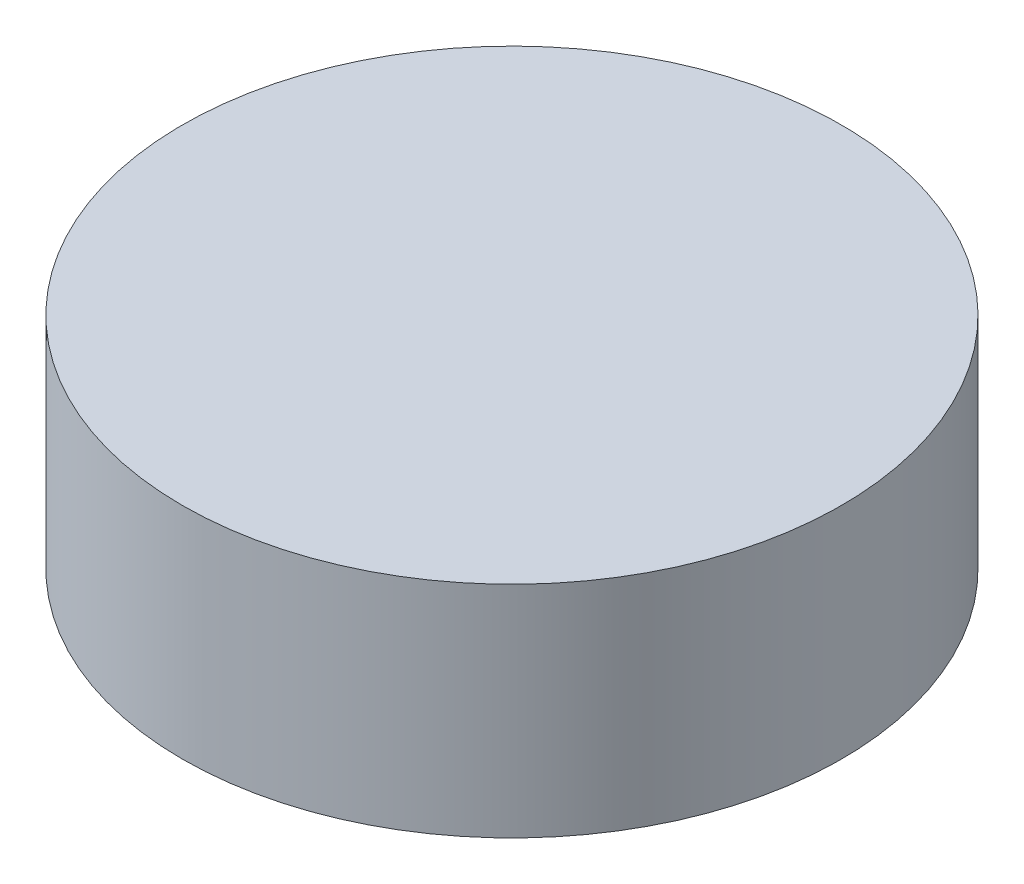
ISO-10303-21;
HEADER;
FILE_DESCRIPTION(('STEP AP214'),'2;1');
FILE_NAME('part.step','',(''),(''),'','','');
FILE_SCHEMA(('AUTOMOTIVE_DESIGN { 1 0 10303 214 1 1 1 1 }'));
ENDSEC;
DATA;
#1=APPLICATION_CONTEXT('core data for automotive mechanical design processes');
#2=APPLICATION_PROTOCOL_DEFINITION('international standard','automotive_design',2000,#1);
#3=PRODUCT_CONTEXT('',#1,'mechanical');
#4=PRODUCT('Part','Part','',(#3));
#5=PRODUCT_RELATED_PRODUCT_CATEGORY('part','',(#4));
#6=PRODUCT_DEFINITION_FORMATION('','',#4);
#7=PRODUCT_DEFINITION_CONTEXT('part definition',#1,'design');
#8=PRODUCT_DEFINITION('design','',#6,#7);
#9=PRODUCT_DEFINITION_SHAPE('','',#8);
#10=(LENGTH_UNIT() NAMED_UNIT(*) SI_UNIT(.MILLI.,.METRE.));
#11=(NAMED_UNIT(*) PLANE_ANGLE_UNIT() SI_UNIT($,.RADIAN.));
#12=(NAMED_UNIT(*) SI_UNIT($,.STERADIAN.) SOLID_ANGLE_UNIT());
#13=UNCERTAINTY_MEASURE_WITH_UNIT(LENGTH_MEASURE(1.E-05),#10,'distance_accuracy_value','');
#14=(GEOMETRIC_REPRESENTATION_CONTEXT(3) GLOBAL_UNCERTAINTY_ASSIGNED_CONTEXT((#13)) GLOBAL_UNIT_ASSIGNED_CONTEXT((#10,
#11,#12)) REPRESENTATION_CONTEXT('',''));
#15=CARTESIAN_POINT('',(0.,0.,0.));
#16=DIRECTION('',(0.,0.,1.));
#17=DIRECTION('',(1.,0.,0.));
#18=AXIS2_PLACEMENT_3D('',#15,#16,#17);
#19=CARTESIAN_POINT('',(0.,5.,0.));
#20=DIRECTION('',(0.,-1.,0.));
#21=DIRECTION('',(0.,0.,-1.));
#22=AXIS2_PLACEMENT_3D('',#19,#20,#21);
#23=CYLINDRICAL_SURFACE('',#22,15.);
#24=CARTESIAN_POINT('',(0.,5.,0.));
#25=DIRECTION('',(0.,1.,0.));
#26=DIRECTION('',(0.,0.,1.));
#27=AXIS2_PLACEMENT_3D('',#24,#25,#26);
#28=CIRCLE('',#27,15.);
#29=CARTESIAN_POINT('',(0.,5.,15.));
#30=VERTEX_POINT('',#29);
#31=EDGE_CURVE('E10',#30,#30,#28,.T.);
#32=ORIENTED_EDGE('',*,*,#31,.F.);
#33=EDGE_LOOP('',(#32));
#34=FACE_BOUND('',#33,.T.);
#35=CARTESIAN_POINT('',(0.,-5.,0.));
#36=DIRECTION('',(0.,1.,0.));
#37=DIRECTION('',(0.,0.,1.));
#38=AXIS2_PLACEMENT_3D('',#35,#36,#37);
#39=CIRCLE('',#38,15.);
#40=CARTESIAN_POINT('',(0.,-5.,15.));
#41=VERTEX_POINT('',#40);
#42=EDGE_CURVE('E36',#41,#41,#39,.T.);
#43=ORIENTED_EDGE('',*,*,#42,.T.);
#44=EDGE_LOOP('',(#43));
#45=FACE_BOUND('',#44,.T.);
#46=ADVANCED_FACE('F33',(#34,#45),#23,.T.);
#47=CARTESIAN_POINT('',(0.,5.,0.));
#48=DIRECTION('',(0.,1.,0.));
#49=DIRECTION('',(0.,0.,1.));
#50=AXIS2_PLACEMENT_3D('',#47,#48,#49);
#51=PLANE('',#50);
#52=ORIENTED_EDGE('',*,*,#31,.T.);
#53=EDGE_LOOP('',(#52));
#54=FACE_BOUND('',#53,.T.);
#55=ADVANCED_FACE('F62',(#54),#51,.T.);
#56=CARTESIAN_POINT('',(0.,-5.,0.));
#57=DIRECTION('',(0.,1.,0.));
#58=DIRECTION('',(0.,0.,1.));
#59=AXIS2_PLACEMENT_3D('',#56,#57,#58);
#60=PLANE('',#59);
#61=CARTESIAN_POINT('',(0.,-5.,0.));
#62=DIRECTION('',(0.,-1.,0.));
#63=DIRECTION('',(0.,0.,-1.));
#64=AXIS2_PLACEMENT_3D('',#61,#62,#63);
#65=CIRCLE('',#64,3.);
#66=CARTESIAN_POINT('',(0.,-5.,-3.));
#67=VERTEX_POINT('',#66);
#68=EDGE_CURVE('E45',#67,#67,#65,.T.);
#69=ORIENTED_EDGE('',*,*,#68,.F.);
#70=EDGE_LOOP('',(#69));
#71=FACE_BOUND('',#70,.T.);
#72=ORIENTED_EDGE('',*,*,#42,.F.);
#73=EDGE_LOOP('',(#72));
#74=FACE_BOUND('',#73,.T.);
#75=ADVANCED_FACE('F56',(#71,#74),#60,.F.);
#76=CARTESIAN_POINT('',(0.,-2.,0.));
#77=DIRECTION('',(0.,-1.,0.));
#78=DIRECTION('',(0.,0.,-1.));
#79=AXIS2_PLACEMENT_3D('',#76,#77,#78);
#80=CYLINDRICAL_SURFACE('',#79,3.);
#81=CARTESIAN_POINT('',(0.,-2.,0.));
#82=DIRECTION('',(0.,-1.,0.));
#83=DIRECTION('',(0.,0.,-1.));
#84=AXIS2_PLACEMENT_3D('',#81,#82,#83);
#85=CIRCLE('',#84,3.);
#86=CARTESIAN_POINT('',(0.,-2.,-3.));
#87=VERTEX_POINT('',#86);
#88=EDGE_CURVE('E43',#87,#87,#85,.T.);
#89=ORIENTED_EDGE('',*,*,#88,.F.);
#90=EDGE_LOOP('',(#89));
#91=FACE_BOUND('',#90,.T.);
#92=ORIENTED_EDGE('',*,*,#68,.T.);
#93=EDGE_LOOP('',(#92));
#94=FACE_BOUND('',#93,.T.);
#95=ADVANCED_FACE('F53',(#91,#94),#80,.F.);
#96=CARTESIAN_POINT('',(0.,-2.,0.));
#97=DIRECTION('',(0.,-1.,0.));
#98=DIRECTION('',(0.,0.,-1.));
#99=AXIS2_PLACEMENT_3D('',#96,#97,#98);
#100=PLANE('',#99);
#101=ORIENTED_EDGE('',*,*,#88,.T.);
#102=EDGE_LOOP('',(#101));
#103=FACE_BOUND('',#102,.T.);
#104=ADVANCED_FACE('F51',(#103),#100,.T.);
#105=CLOSED_SHELL('',(#46,#55,#75,#95,#104));
#106=MANIFOLD_SOLID_BREP('B2',#105);
#107=ADVANCED_BREP_SHAPE_REPRESENTATION('',(#18,#106),#14);
#108=SHAPE_DEFINITION_REPRESENTATION(#9,#107);
ENDSEC;
END-ISO-10303-21;
